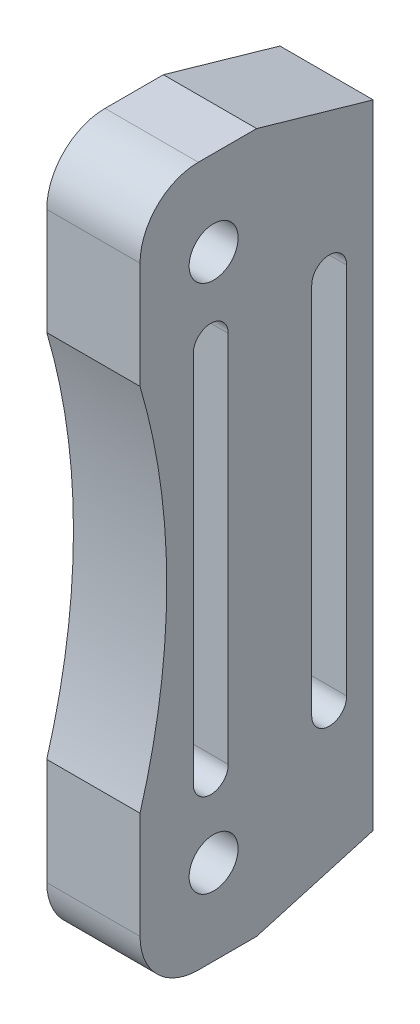
ISO-10303-21;
HEADER;
FILE_DESCRIPTION(('STEP AP214'),'2;1');
FILE_NAME('part.step','',(''),(''),'','','');
FILE_SCHEMA(('AUTOMOTIVE_DESIGN { 1 0 10303 214 1 1 1 1 }'));
ENDSEC;
DATA;
#1=APPLICATION_CONTEXT('core data for automotive mechanical design processes');
#2=APPLICATION_PROTOCOL_DEFINITION('international standard','automotive_design',2000,#1);
#3=PRODUCT_CONTEXT('',#1,'mechanical');
#4=PRODUCT('Part','Part','',(#3));
#5=PRODUCT_RELATED_PRODUCT_CATEGORY('part','',(#4));
#6=PRODUCT_DEFINITION_FORMATION('','',#4);
#7=PRODUCT_DEFINITION_CONTEXT('part definition',#1,'design');
#8=PRODUCT_DEFINITION('design','',#6,#7);
#9=PRODUCT_DEFINITION_SHAPE('','',#8);
#10=(LENGTH_UNIT() NAMED_UNIT(*) SI_UNIT(.MILLI.,.METRE.));
#11=(NAMED_UNIT(*) PLANE_ANGLE_UNIT() SI_UNIT($,.RADIAN.));
#12=(NAMED_UNIT(*) SI_UNIT($,.STERADIAN.) SOLID_ANGLE_UNIT());
#13=UNCERTAINTY_MEASURE_WITH_UNIT(LENGTH_MEASURE(1.E-05),#10,'distance_accuracy_value','');
#14=(GEOMETRIC_REPRESENTATION_CONTEXT(3) GLOBAL_UNCERTAINTY_ASSIGNED_CONTEXT((#13)) GLOBAL_UNIT_ASSIGNED_CONTEXT((#10,
#11,#12)) REPRESENTATION_CONTEXT('',''));
#15=CARTESIAN_POINT('',(0.,0.,0.));
#16=DIRECTION('',(0.,0.,1.));
#17=DIRECTION('',(1.,0.,0.));
#18=AXIS2_PLACEMENT_3D('',#15,#16,#17);
#19=CARTESIAN_POINT('',(-8.,0.,63.71));
#20=DIRECTION('',(1.,0.,0.));
#21=DIRECTION('',(0.,0.,-1.));
#22=AXIS2_PLACEMENT_3D('',#19,#20,#21);
#23=CYLINDRICAL_SURFACE('',#22,56.);
#24=CARTESIAN_POINT('',(0.,0.,63.71));
#25=DIRECTION('',(1.,0.,0.));
#26=DIRECTION('',(0.,0.,-1.));
#27=AXIS2_PLACEMENT_3D('',#24,#25,#26);
#28=CIRCLE('',#27,56.);
#29=CARTESIAN_POINT('',(0.,-15.8504227072971,10.));
#30=VERTEX_POINT('',#29);
#31=CARTESIAN_POINT('',(0.,15.8504227072971,10.));
#32=VERTEX_POINT('',#31);
#33=EDGE_CURVE('E185',#30,#32,#28,.T.);
#34=ORIENTED_EDGE('',*,*,#33,.T.);
#35=DIRECTION('',(1.,0.,0.));
#36=VECTOR('',#35,1.);
#37=CARTESIAN_POINT('',(-8.,15.8504227072971,10.));
#38=LINE('',#37,#36);
#39=CARTESIAN_POINT('',(-8.,15.8504227072971,10.));
#40=VERTEX_POINT('',#39);
#41=EDGE_CURVE('E282',#40,#32,#38,.T.);
#42=ORIENTED_EDGE('',*,*,#41,.F.);
#43=CARTESIAN_POINT('',(-8.,0.,63.71));
#44=DIRECTION('',(1.,0.,0.));
#45=DIRECTION('',(0.,0.,-1.));
#46=AXIS2_PLACEMENT_3D('',#43,#44,#45);
#47=CIRCLE('',#46,56.);
#48=CARTESIAN_POINT('',(-8.,-15.8504227072971,10.));
#49=VERTEX_POINT('',#48);
#50=EDGE_CURVE('E238',#49,#40,#47,.T.);
#51=ORIENTED_EDGE('',*,*,#50,.F.);
#52=DIRECTION('',(1.,0.,0.));
#53=VECTOR('',#52,1.);
#54=CARTESIAN_POINT('',(-8.,-15.8504227072971,10.));
#55=LINE('',#54,#53);
#56=EDGE_CURVE('E261',#49,#30,#55,.T.);
#57=ORIENTED_EDGE('',*,*,#56,.T.);
#58=EDGE_LOOP('',(#34,#42,#51,#57));
#59=FACE_BOUND('',#58,.T.);
#60=ADVANCED_FACE('F42',(#59),#23,.F.);
#61=CARTESIAN_POINT('',(-8.,0.,10.));
#62=DIRECTION('',(0.,0.,1.));
#63=DIRECTION('',(1.,0.,0.));
#64=AXIS2_PLACEMENT_3D('',#61,#62,#63);
#65=PLANE('',#64);
#66=DIRECTION('',(0.,-1.,0.));
#67=VECTOR('',#66,1.);
#68=CARTESIAN_POINT('',(0.,0.,10.));
#69=LINE('',#68,#67);
#70=CARTESIAN_POINT('',(0.,25.,10.));
#71=VERTEX_POINT('',#70);
#72=EDGE_CURVE('E268',#71,#32,#69,.T.);
#73=ORIENTED_EDGE('',*,*,#72,.F.);
#74=DIRECTION('',(1.,0.,0.));
#75=VECTOR('',#74,1.);
#76=CARTESIAN_POINT('',(-8.,25.,10.));
#77=LINE('',#76,#75);
#78=CARTESIAN_POINT('',(-8.,25.,10.));
#79=VERTEX_POINT('',#78);
#80=EDGE_CURVE('E302',#71,#79,#77,.F.);
#81=ORIENTED_EDGE('',*,*,#80,.T.);
#82=DIRECTION('',(0.,-1.,0.));
#83=VECTOR('',#82,1.);
#84=CARTESIAN_POINT('',(-8.,0.,10.));
#85=LINE('',#84,#83);
#86=EDGE_CURVE('E246',#79,#40,#85,.T.);
#87=ORIENTED_EDGE('',*,*,#86,.T.);
#88=ORIENTED_EDGE('',*,*,#41,.T.);
#89=EDGE_LOOP('',(#73,#81,#87,#88));
#90=FACE_BOUND('',#89,.T.);
#91=ADVANCED_FACE('F353',(#90),#65,.T.);
#92=CARTESIAN_POINT('',(-8.,30.,0.));
#93=DIRECTION('',(0.,-1.,0.));
#94=DIRECTION('',(0.,0.,-1.));
#95=AXIS2_PLACEMENT_3D('',#92,#93,#94);
#96=PLANE('',#95);
#97=DIRECTION('',(0.,0.,-1.));
#98=VECTOR('',#97,1.);
#99=CARTESIAN_POINT('',(0.,30.,0.));
#100=LINE('',#99,#98);
#101=CARTESIAN_POINT('',(0.,30.,5.));
#102=VERTEX_POINT('',#101);
#103=CARTESIAN_POINT('',(0.,30.,1.05818132034585E-13));
#104=VERTEX_POINT('',#103);
#105=EDGE_CURVE('E274',#102,#104,#100,.T.);
#106=ORIENTED_EDGE('',*,*,#105,.T.);
#107=DIRECTION('',(-1.,0.,0.));
#108=VECTOR('',#107,1.);
#109=CARTESIAN_POINT('',(-8.,30.,1.05818132034585E-13));
#110=LINE('',#109,#108);
#111=CARTESIAN_POINT('',(-8.,30.,1.05818132034585E-13));
#112=VERTEX_POINT('',#111);
#113=EDGE_CURVE('E11',#104,#112,#110,.T.);
#114=ORIENTED_EDGE('',*,*,#113,.T.);
#115=DIRECTION('',(0.,0.,-1.));
#116=VECTOR('',#115,1.);
#117=CARTESIAN_POINT('',(-8.,30.,0.));
#118=LINE('',#117,#116);
#119=CARTESIAN_POINT('',(-8.,30.,5.));
#120=VERTEX_POINT('',#119);
#121=EDGE_CURVE('E252',#120,#112,#118,.T.);
#122=ORIENTED_EDGE('',*,*,#121,.F.);
#123=DIRECTION('',(1.,0.,0.));
#124=VECTOR('',#123,1.);
#125=CARTESIAN_POINT('',(0.,30.,5.));
#126=LINE('',#125,#124);
#127=EDGE_CURVE('E299',#120,#102,#126,.T.);
#128=ORIENTED_EDGE('',*,*,#127,.T.);
#129=EDGE_LOOP('',(#106,#114,#122,#128));
#130=FACE_BOUND('',#129,.T.);
#131=ADVANCED_FACE('F343',(#130),#96,.F.);
#132=CARTESIAN_POINT('',(-8.,0.,-10.));
#133=DIRECTION('',(0.,0.,1.));
#134=DIRECTION('',(1.,0.,0.));
#135=AXIS2_PLACEMENT_3D('',#132,#133,#134);
#136=PLANE('',#135);
#137=DIRECTION('',(0.,-1.,0.));
#138=VECTOR('',#137,1.);
#139=CARTESIAN_POINT('',(0.,0.,-10.));
#140=LINE('',#139,#138);
#141=CARTESIAN_POINT('',(0.,27.1325461424119,-10.));
#142=VERTEX_POINT('',#141);
#143=CARTESIAN_POINT('',(0.,-27.1325461424119,-10.));
#144=VERTEX_POINT('',#143);
#145=EDGE_CURVE('E271',#142,#144,#140,.T.);
#146=ORIENTED_EDGE('',*,*,#145,.T.);
#147=DIRECTION('',(-1.,0.,0.));
#148=VECTOR('',#147,1.);
#149=CARTESIAN_POINT('',(-8.,-27.1325461424119,-10.));
#150=LINE('',#149,#148);
#151=CARTESIAN_POINT('',(-8.,-27.1325461424119,-10.));
#152=VERTEX_POINT('',#151);
#153=EDGE_CURVE('E314',#144,#152,#150,.T.);
#154=ORIENTED_EDGE('',*,*,#153,.T.);
#155=DIRECTION('',(0.,-1.,0.));
#156=VECTOR('',#155,1.);
#157=CARTESIAN_POINT('',(-8.,0.,-10.));
#158=LINE('',#157,#156);
#159=CARTESIAN_POINT('',(-8.,27.1325461424119,-10.));
#160=VERTEX_POINT('',#159);
#161=EDGE_CURVE('E249',#160,#152,#158,.T.);
#162=ORIENTED_EDGE('',*,*,#161,.F.);
#163=DIRECTION('',(1.,0.,0.));
#164=VECTOR('',#163,1.);
#165=CARTESIAN_POINT('',(-8.,27.1325461424119,-10.));
#166=LINE('',#165,#164);
#167=EDGE_CURVE('E311',#160,#142,#166,.T.);
#168=ORIENTED_EDGE('',*,*,#167,.T.);
#169=EDGE_LOOP('',(#146,#154,#162,#168));
#170=FACE_BOUND('',#169,.T.);
#171=ADVANCED_FACE('F336',(#170),#136,.F.);
#172=CARTESIAN_POINT('',(-8.,-30.,0.));
#173=DIRECTION('',(0.,-1.,0.));
#174=DIRECTION('',(0.,0.,-1.));
#175=AXIS2_PLACEMENT_3D('',#172,#173,#174);
#176=PLANE('',#175);
#177=DIRECTION('',(0.,0.,-1.));
#178=VECTOR('',#177,1.);
#179=CARTESIAN_POINT('',(-8.,-30.,0.));
#180=LINE('',#179,#178);
#181=CARTESIAN_POINT('',(-8.,-30.,5.));
#182=VERTEX_POINT('',#181);
#183=CARTESIAN_POINT('',(-8.,-30.,1.05818132034585E-13));
#184=VERTEX_POINT('',#183);
#185=EDGE_CURVE('E245',#182,#184,#180,.T.);
#186=ORIENTED_EDGE('',*,*,#185,.T.);
#187=DIRECTION('',(1.,0.,0.));
#188=VECTOR('',#187,1.);
#189=CARTESIAN_POINT('',(0.,-30.,1.05818132034585E-13));
#190=LINE('',#189,#188);
#191=CARTESIAN_POINT('',(0.,-30.,1.05818132034585E-13));
#192=VERTEX_POINT('',#191);
#193=EDGE_CURVE('E304',#184,#192,#190,.T.);
#194=ORIENTED_EDGE('',*,*,#193,.T.);
#195=DIRECTION('',(0.,0.,-1.));
#196=VECTOR('',#195,1.);
#197=CARTESIAN_POINT('',(0.,-30.,0.));
#198=LINE('',#197,#196);
#199=CARTESIAN_POINT('',(0.,-30.,5.));
#200=VERTEX_POINT('',#199);
#201=EDGE_CURVE('E267',#200,#192,#198,.T.);
#202=ORIENTED_EDGE('',*,*,#201,.F.);
#203=DIRECTION('',(1.,0.,0.));
#204=VECTOR('',#203,1.);
#205=CARTESIAN_POINT('',(-8.,-30.,5.));
#206=LINE('',#205,#204);
#207=EDGE_CURVE('E293',#200,#182,#206,.F.);
#208=ORIENTED_EDGE('',*,*,#207,.T.);
#209=EDGE_LOOP('',(#186,#194,#202,#208));
#210=FACE_BOUND('',#209,.T.);
#211=ADVANCED_FACE('F327',(#210),#176,.T.);
#212=CARTESIAN_POINT('',(-8.,22.685,3.69000000000001));
#213=DIRECTION('',(1.,0.,0.));
#214=DIRECTION('',(0.,0.,-1.));
#215=AXIS2_PLACEMENT_3D('',#212,#213,#214);
#216=CYLINDRICAL_SURFACE('',#215,2.1);
#217=CARTESIAN_POINT('',(-8.,22.685,3.69000000000001));
#218=DIRECTION('',(1.,0.,0.));
#219=DIRECTION('',(0.,0.,-1.));
#220=AXIS2_PLACEMENT_3D('',#217,#218,#219);
#221=CIRCLE('',#220,2.1);
#222=CARTESIAN_POINT('',(-8.,22.685,1.59));
#223=VERTEX_POINT('',#222);
#224=EDGE_CURVE('E255',#223,#223,#221,.T.);
#225=ORIENTED_EDGE('',*,*,#224,.F.);
#226=EDGE_LOOP('',(#225));
#227=FACE_BOUND('',#226,.T.);
#228=CARTESIAN_POINT('',(0.,22.685,3.69000000000001));
#229=DIRECTION('',(1.,0.,0.));
#230=DIRECTION('',(0.,0.,-1.));
#231=AXIS2_PLACEMENT_3D('',#228,#229,#230);
#232=CIRCLE('',#231,2.1);
#233=CARTESIAN_POINT('',(0.,22.685,1.59));
#234=VERTEX_POINT('',#233);
#235=EDGE_CURVE('E277',#234,#234,#232,.T.);
#236=ORIENTED_EDGE('',*,*,#235,.T.);
#237=EDGE_LOOP('',(#236));
#238=FACE_BOUND('',#237,.T.);
#239=ADVANCED_FACE('F383',(#227,#238),#216,.F.);
#240=CARTESIAN_POINT('',(-8.,-25.,10.));
#241=VERTEX_POINT('',#240);
#242=EDGE_CURVE('E241',#49,#241,#85,.T.);
#243=ORIENTED_EDGE('',*,*,#242,.T.);
#244=DIRECTION('',(1.,0.,0.));
#245=VECTOR('',#244,1.);
#246=CARTESIAN_POINT('',(-8.,-25.,10.));
#247=LINE('',#246,#245);
#248=CARTESIAN_POINT('',(0.,-25.,10.));
#249=VERTEX_POINT('',#248);
#250=EDGE_CURVE('E285',#241,#249,#247,.T.);
#251=ORIENTED_EDGE('',*,*,#250,.T.);
#252=EDGE_CURVE('E264',#30,#249,#69,.T.);
#253=ORIENTED_EDGE('',*,*,#252,.F.);
#254=ORIENTED_EDGE('',*,*,#56,.F.);
#255=EDGE_LOOP('',(#243,#251,#253,#254));
#256=FACE_BOUND('',#255,.T.);
#257=ADVANCED_FACE('F360',(#256),#65,.T.);
#258=CARTESIAN_POINT('',(-8.,-22.685,3.69000000000001));
#259=DIRECTION('',(1.,0.,0.));
#260=DIRECTION('',(0.,0.,-1.));
#261=AXIS2_PLACEMENT_3D('',#258,#259,#260);
#262=CYLINDRICAL_SURFACE('',#261,2.1);
#263=CARTESIAN_POINT('',(-8.,-22.685,3.69000000000001));
#264=DIRECTION('',(1.,0.,0.));
#265=DIRECTION('',(0.,0.,-1.));
#266=AXIS2_PLACEMENT_3D('',#263,#264,#265);
#267=CIRCLE('',#266,2.1);
#268=CARTESIAN_POINT('',(-8.,-22.685,1.59));
#269=VERTEX_POINT('',#268);
#270=EDGE_CURVE('E258',#269,#269,#267,.F.);
#271=ORIENTED_EDGE('',*,*,#270,.T.);
#272=EDGE_LOOP('',(#271));
#273=FACE_BOUND('',#272,.T.);
#274=CARTESIAN_POINT('',(0.,-22.685,3.69000000000001));
#275=DIRECTION('',(1.,0.,0.));
#276=DIRECTION('',(0.,0.,-1.));
#277=AXIS2_PLACEMENT_3D('',#274,#275,#276);
#278=CIRCLE('',#277,2.1);
#279=CARTESIAN_POINT('',(0.,-22.685,1.59));
#280=VERTEX_POINT('',#279);
#281=EDGE_CURVE('E242',#280,#280,#278,.F.);
#282=ORIENTED_EDGE('',*,*,#281,.F.);
#283=EDGE_LOOP('',(#282));
#284=FACE_BOUND('',#283,.T.);
#285=ADVANCED_FACE('F391',(#273,#284),#262,.F.);
#286=CARTESIAN_POINT('',(-8.,0.,0.));
#287=DIRECTION('',(1.,0.,0.));
#288=DIRECTION('',(0.,0.,-1.));
#289=AXIS2_PLACEMENT_3D('',#286,#287,#288);
#290=PLANE('',#289);
#291=DIRECTION('',(0.,-1.,0.));
#292=VECTOR('',#291,1.);
#293=CARTESIAN_POINT('',(-8.,16.,-7.725));
#294=LINE('',#293,#292);
#295=CARTESIAN_POINT('',(-8.,16.,-7.725));
#296=VERTEX_POINT('',#295);
#297=CARTESIAN_POINT('',(-8.,-16.,-7.725));
#298=VERTEX_POINT('',#297);
#299=EDGE_CURVE('E191',#296,#298,#294,.T.);
#300=ORIENTED_EDGE('',*,*,#299,.F.);
#301=CARTESIAN_POINT('',(-8.,16.,-6.22499999999999));
#302=DIRECTION('',(1.,0.,0.));
#303=DIRECTION('',(0.,0.,-1.));
#304=AXIS2_PLACEMENT_3D('',#301,#302,#303);
#305=CIRCLE('',#304,1.50000000000001);
#306=CARTESIAN_POINT('',(-8.,16.,-4.72499999999998));
#307=VERTEX_POINT('',#306);
#308=EDGE_CURVE('E171',#307,#296,#305,.F.);
#309=ORIENTED_EDGE('',*,*,#308,.F.);
#310=DIRECTION('',(0.,1.,0.));
#311=VECTOR('',#310,1.);
#312=CARTESIAN_POINT('',(-8.,16.,-4.72499999999998));
#313=LINE('',#312,#311);
#314=CARTESIAN_POINT('',(-8.,-16.,-4.72499999999998));
#315=VERTEX_POINT('',#314);
#316=EDGE_CURVE('E182',#315,#307,#313,.T.);
#317=ORIENTED_EDGE('',*,*,#316,.F.);
#318=CARTESIAN_POINT('',(-8.,-16.,-6.22499999999999));
#319=DIRECTION('',(1.,0.,0.));
#320=DIRECTION('',(0.,0.,-1.));
#321=AXIS2_PLACEMENT_3D('',#318,#319,#320);
#322=CIRCLE('',#321,1.50000000000001);
#323=EDGE_CURVE('E58',#298,#315,#322,.F.);
#324=ORIENTED_EDGE('',*,*,#323,.F.);
#325=EDGE_LOOP('',(#300,#309,#317,#324));
#326=FACE_BOUND('',#325,.T.);
#327=DIRECTION('',(0.,-1.,0.));
#328=VECTOR('',#327,1.);
#329=CARTESIAN_POINT('',(-8.,16.,2.43499999999999));
#330=LINE('',#329,#328);
#331=CARTESIAN_POINT('',(-8.,16.,2.43499999999999));
#332=VERTEX_POINT('',#331);
#333=CARTESIAN_POINT('',(-8.,-16.,2.43499999999999));
#334=VERTEX_POINT('',#333);
#335=EDGE_CURVE('E234',#332,#334,#330,.T.);
#336=ORIENTED_EDGE('',*,*,#335,.F.);
#337=CARTESIAN_POINT('',(-8.,16.,3.935));
#338=DIRECTION('',(1.,0.,0.));
#339=DIRECTION('',(0.,0.,-1.));
#340=AXIS2_PLACEMENT_3D('',#337,#338,#339);
#341=CIRCLE('',#340,1.50000000000001);
#342=CARTESIAN_POINT('',(-8.,16.,5.435));
#343=VERTEX_POINT('',#342);
#344=EDGE_CURVE('E231',#343,#332,#341,.F.);
#345=ORIENTED_EDGE('',*,*,#344,.F.);
#346=DIRECTION('',(0.,1.,0.));
#347=VECTOR('',#346,1.);
#348=CARTESIAN_POINT('',(-8.,16.,5.435));
#349=LINE('',#348,#347);
#350=CARTESIAN_POINT('',(-8.,-16.,5.435));
#351=VERTEX_POINT('',#350);
#352=EDGE_CURVE('E208',#351,#343,#349,.T.);
#353=ORIENTED_EDGE('',*,*,#352,.F.);
#354=CARTESIAN_POINT('',(-8.,-16.,3.935));
#355=DIRECTION('',(1.,0.,0.));
#356=DIRECTION('',(0.,0.,-1.));
#357=AXIS2_PLACEMENT_3D('',#354,#355,#356);
#358=CIRCLE('',#357,1.50000000000001);
#359=EDGE_CURVE('E66',#334,#351,#358,.F.);
#360=ORIENTED_EDGE('',*,*,#359,.F.);
#361=EDGE_LOOP('',(#336,#345,#353,#360));
#362=FACE_BOUND('',#361,.T.);
#363=ORIENTED_EDGE('',*,*,#161,.T.);
#364=DIRECTION('',(0.,-0.275637355816996,0.96126169593832));
#365=VECTOR('',#364,1.);
#366=CARTESIAN_POINT('',(-8.,-30.,1.05818132034585E-13));
#367=LINE('',#366,#365);
#368=EDGE_CURVE('E51',#152,#184,#367,.T.);
#369=ORIENTED_EDGE('',*,*,#368,.T.);
#370=ORIENTED_EDGE('',*,*,#185,.F.);
#371=CARTESIAN_POINT('',(-8.,-25.,5.));
#372=DIRECTION('',(1.,0.,0.));
#373=DIRECTION('',(0.,0.,-1.));
#374=AXIS2_PLACEMENT_3D('',#371,#372,#373);
#375=CIRCLE('',#374,5.);
#376=EDGE_CURVE('E297',#182,#241,#375,.F.);
#377=ORIENTED_EDGE('',*,*,#376,.T.);
#378=ORIENTED_EDGE('',*,*,#242,.F.);
#379=ORIENTED_EDGE('',*,*,#50,.T.);
#380=ORIENTED_EDGE('',*,*,#86,.F.);
#381=CARTESIAN_POINT('',(-8.,25.,5.));
#382=DIRECTION('',(1.,0.,0.));
#383=DIRECTION('',(0.,0.,-1.));
#384=AXIS2_PLACEMENT_3D('',#381,#382,#383);
#385=CIRCLE('',#384,5.);
#386=EDGE_CURVE('E295',#79,#120,#385,.F.);
#387=ORIENTED_EDGE('',*,*,#386,.T.);
#388=ORIENTED_EDGE('',*,*,#121,.T.);
#389=DIRECTION('',(0.,0.275637355816996,0.96126169593832));
#390=VECTOR('',#389,1.);
#391=CARTESIAN_POINT('',(-8.,27.1325461424119,-10.));
#392=LINE('',#391,#390);
#393=EDGE_CURVE('E316',#112,#160,#392,.F.);
#394=ORIENTED_EDGE('',*,*,#393,.T.);
#395=EDGE_LOOP('',(#363,#369,#370,#377,#378,#379,#380,#387,#388,#394));
#396=FACE_BOUND('',#395,.T.);
#397=ORIENTED_EDGE('',*,*,#224,.T.);
#398=EDGE_LOOP('',(#397));
#399=FACE_BOUND('',#398,.T.);
#400=ORIENTED_EDGE('',*,*,#270,.F.);
#401=EDGE_LOOP('',(#400));
#402=FACE_BOUND('',#401,.T.);
#403=ADVANCED_FACE('F188',(#326,#362,#396,#399,#402),#290,.F.);
#404=CARTESIAN_POINT('',(0.,0.,0.));
#405=DIRECTION('',(1.,0.,0.));
#406=DIRECTION('',(0.,0.,-1.));
#407=AXIS2_PLACEMENT_3D('',#404,#405,#406);
#408=PLANE('',#407);
#409=CARTESIAN_POINT('',(0.,16.,-6.22499999999999));
#410=DIRECTION('',(1.,0.,0.));
#411=DIRECTION('',(0.,0.,-1.));
#412=AXIS2_PLACEMENT_3D('',#409,#410,#411);
#413=CIRCLE('',#412,1.50000000000001);
#414=CARTESIAN_POINT('',(0.,16.,-7.725));
#415=VERTEX_POINT('',#414);
#416=CARTESIAN_POINT('',(0.,16.,-4.72499999999998));
#417=VERTEX_POINT('',#416);
#418=EDGE_CURVE('E174',#415,#417,#413,.T.);
#419=ORIENTED_EDGE('',*,*,#418,.F.);
#420=DIRECTION('',(0.,1.,0.));
#421=VECTOR('',#420,1.);
#422=CARTESIAN_POINT('',(0.,16.,-7.725));
#423=LINE('',#422,#421);
#424=CARTESIAN_POINT('',(0.,-16.,-7.725));
#425=VERTEX_POINT('',#424);
#426=EDGE_CURVE('E179',#425,#415,#423,.T.);
#427=ORIENTED_EDGE('',*,*,#426,.F.);
#428=CARTESIAN_POINT('',(0.,-16.,-6.22499999999999));
#429=DIRECTION('',(1.,0.,0.));
#430=DIRECTION('',(0.,0.,-1.));
#431=AXIS2_PLACEMENT_3D('',#428,#429,#430);
#432=CIRCLE('',#431,1.50000000000001);
#433=CARTESIAN_POINT('',(0.,-16.,-4.72499999999999));
#434=VERTEX_POINT('',#433);
#435=EDGE_CURVE('E199',#434,#425,#432,.T.);
#436=ORIENTED_EDGE('',*,*,#435,.F.);
#437=DIRECTION('',(0.,-1.,0.));
#438=VECTOR('',#437,1.);
#439=CARTESIAN_POINT('',(0.,16.,-4.72499999999998));
#440=LINE('',#439,#438);
#441=EDGE_CURVE('E193',#417,#434,#440,.T.);
#442=ORIENTED_EDGE('',*,*,#441,.F.);
#443=EDGE_LOOP('',(#419,#427,#436,#442));
#444=FACE_BOUND('',#443,.T.);
#445=CARTESIAN_POINT('',(0.,16.,3.935));
#446=DIRECTION('',(1.,0.,0.));
#447=DIRECTION('',(0.,0.,1.));
#448=AXIS2_PLACEMENT_3D('',#445,#446,#447);
#449=CIRCLE('',#448,1.50000000000001);
#450=CARTESIAN_POINT('',(0.,16.,2.43499999999999));
#451=VERTEX_POINT('',#450);
#452=CARTESIAN_POINT('',(0.,16.,5.435));
#453=VERTEX_POINT('',#452);
#454=EDGE_CURVE('E229',#451,#453,#449,.T.);
#455=ORIENTED_EDGE('',*,*,#454,.F.);
#456=DIRECTION('',(0.,1.,0.));
#457=VECTOR('',#456,1.);
#458=CARTESIAN_POINT('',(0.,16.,2.43499999999999));
#459=LINE('',#458,#457);
#460=CARTESIAN_POINT('',(0.,-16.,2.43499999999999));
#461=VERTEX_POINT('',#460);
#462=EDGE_CURVE('E215',#461,#451,#459,.T.);
#463=ORIENTED_EDGE('',*,*,#462,.F.);
#464=CARTESIAN_POINT('',(0.,-16.,3.935));
#465=DIRECTION('',(1.,0.,0.));
#466=DIRECTION('',(0.,0.,1.));
#467=AXIS2_PLACEMENT_3D('',#464,#465,#466);
#468=CIRCLE('',#467,1.50000000000001);
#469=CARTESIAN_POINT('',(0.,-16.,5.435));
#470=VERTEX_POINT('',#469);
#471=EDGE_CURVE('E223',#470,#461,#468,.T.);
#472=ORIENTED_EDGE('',*,*,#471,.F.);
#473=DIRECTION('',(0.,-1.,0.));
#474=VECTOR('',#473,1.);
#475=CARTESIAN_POINT('',(0.,16.,5.435));
#476=LINE('',#475,#474);
#477=EDGE_CURVE('E226',#453,#470,#476,.T.);
#478=ORIENTED_EDGE('',*,*,#477,.F.);
#479=EDGE_LOOP('',(#455,#463,#472,#478));
#480=FACE_BOUND('',#479,.T.);
#481=ORIENTED_EDGE('',*,*,#201,.T.);
#482=DIRECTION('',(0.,0.275637355816996,-0.96126169593832));
#483=VECTOR('',#482,1.);
#484=CARTESIAN_POINT('',(0.,-27.7207214423464,-7.94878896349799));
#485=LINE('',#484,#483);
#486=EDGE_CURVE('E309',#192,#144,#485,.T.);
#487=ORIENTED_EDGE('',*,*,#486,.T.);
#488=ORIENTED_EDGE('',*,*,#145,.F.);
#489=DIRECTION('',(0.,-0.275637355816996,-0.96126169593832));
#490=VECTOR('',#489,1.);
#491=CARTESIAN_POINT('',(0.,27.7207214423464,-7.94878896349799));
#492=LINE('',#491,#490);
#493=EDGE_CURVE('E307',#142,#104,#492,.F.);
#494=ORIENTED_EDGE('',*,*,#493,.T.);
#495=ORIENTED_EDGE('',*,*,#105,.F.);
#496=CARTESIAN_POINT('',(0.,25.,5.));
#497=DIRECTION('',(1.,0.,0.));
#498=DIRECTION('',(0.,0.,-1.));
#499=AXIS2_PLACEMENT_3D('',#496,#497,#498);
#500=CIRCLE('',#499,5.);
#501=EDGE_CURVE('E289',#102,#71,#500,.T.);
#502=ORIENTED_EDGE('',*,*,#501,.T.);
#503=ORIENTED_EDGE('',*,*,#72,.T.);
#504=ORIENTED_EDGE('',*,*,#33,.F.);
#505=ORIENTED_EDGE('',*,*,#252,.T.);
#506=CARTESIAN_POINT('',(0.,-25.,5.));
#507=DIRECTION('',(1.,0.,0.));
#508=DIRECTION('',(0.,0.,-1.));
#509=AXIS2_PLACEMENT_3D('',#506,#507,#508);
#510=CIRCLE('',#509,5.);
#511=EDGE_CURVE('E291',#249,#200,#510,.T.);
#512=ORIENTED_EDGE('',*,*,#511,.T.);
#513=EDGE_LOOP('',(#481,#487,#488,#494,#495,#502,#503,#504,#505,#512));
#514=FACE_BOUND('',#513,.T.);
#515=ORIENTED_EDGE('',*,*,#235,.F.);
#516=EDGE_LOOP('',(#515));
#517=FACE_BOUND('',#516,.T.);
#518=ORIENTED_EDGE('',*,*,#281,.T.);
#519=EDGE_LOOP('',(#518));
#520=FACE_BOUND('',#519,.T.);
#521=ADVANCED_FACE('F333',(#444,#480,#514,#517,#520),#408,.T.);
#522=CARTESIAN_POINT('',(-8.,-25.,5.));
#523=DIRECTION('',(1.,0.,0.));
#524=DIRECTION('',(0.,0.,-1.));
#525=AXIS2_PLACEMENT_3D('',#522,#523,#524);
#526=CYLINDRICAL_SURFACE('',#525,5.);
#527=ORIENTED_EDGE('',*,*,#376,.F.);
#528=ORIENTED_EDGE('',*,*,#207,.F.);
#529=ORIENTED_EDGE('',*,*,#511,.F.);
#530=ORIENTED_EDGE('',*,*,#250,.F.);
#531=EDGE_LOOP('',(#527,#528,#529,#530));
#532=FACE_BOUND('',#531,.T.);
#533=ADVANCED_FACE('F364',(#532),#526,.T.);
#534=CARTESIAN_POINT('',(-8.,25.,5.));
#535=DIRECTION('',(-1.,0.,0.));
#536=DIRECTION('',(0.,0.,1.));
#537=AXIS2_PLACEMENT_3D('',#534,#535,#536);
#538=CYLINDRICAL_SURFACE('',#537,5.);
#539=ORIENTED_EDGE('',*,*,#386,.F.);
#540=ORIENTED_EDGE('',*,*,#80,.F.);
#541=ORIENTED_EDGE('',*,*,#501,.F.);
#542=ORIENTED_EDGE('',*,*,#127,.F.);
#543=EDGE_LOOP('',(#539,#540,#541,#542));
#544=FACE_BOUND('',#543,.T.);
#545=ADVANCED_FACE('F348',(#544),#538,.T.);
#546=CARTESIAN_POINT('',(-8.,-30.,1.05818132034585E-13));
#547=DIRECTION('',(0.,-0.96126169593832,-0.275637355816996));
#548=DIRECTION('',(-1.,0.,0.));
#549=AXIS2_PLACEMENT_3D('',#546,#547,#548);
#550=PLANE('',#549);
#551=ORIENTED_EDGE('',*,*,#368,.F.);
#552=ORIENTED_EDGE('',*,*,#153,.F.);
#553=ORIENTED_EDGE('',*,*,#486,.F.);
#554=ORIENTED_EDGE('',*,*,#193,.F.);
#555=EDGE_LOOP('',(#551,#552,#553,#554));
#556=FACE_BOUND('',#555,.T.);
#557=ADVANCED_FACE('F330',(#556),#550,.T.);
#558=CARTESIAN_POINT('',(-8.,27.1325461424119,-10.));
#559=DIRECTION('',(0.,-0.96126169593832,0.275637355816996));
#560=DIRECTION('',(1.,0.,0.));
#561=AXIS2_PLACEMENT_3D('',#558,#559,#560);
#562=PLANE('',#561);
#563=ORIENTED_EDGE('',*,*,#393,.F.);
#564=ORIENTED_EDGE('',*,*,#113,.F.);
#565=ORIENTED_EDGE('',*,*,#493,.F.);
#566=ORIENTED_EDGE('',*,*,#167,.F.);
#567=EDGE_LOOP('',(#563,#564,#565,#566));
#568=FACE_BOUND('',#567,.T.);
#569=ADVANCED_FACE('F45',(#568),#562,.F.);
#570=CARTESIAN_POINT('',(-8.001,16.,3.935));
#571=DIRECTION('',(1.,0.,0.));
#572=DIRECTION('',(0.,0.,-1.));
#573=AXIS2_PLACEMENT_3D('',#570,#571,#572);
#574=CYLINDRICAL_SURFACE('',#573,1.50000000000001);
#575=ORIENTED_EDGE('',*,*,#344,.T.);
#576=DIRECTION('',(1.,0.,0.));
#577=VECTOR('',#576,1.);
#578=CARTESIAN_POINT('',(-8.001,16.,2.43499999999999));
#579=LINE('',#578,#577);
#580=EDGE_CURVE('E211',#332,#451,#579,.T.);
#581=ORIENTED_EDGE('',*,*,#580,.T.);
#582=ORIENTED_EDGE('',*,*,#454,.T.);
#583=DIRECTION('',(1.,0.,0.));
#584=VECTOR('',#583,1.);
#585=CARTESIAN_POINT('',(-8.001,16.,5.435));
#586=LINE('',#585,#584);
#587=EDGE_CURVE('E212',#343,#453,#586,.T.);
#588=ORIENTED_EDGE('',*,*,#587,.F.);
#589=EDGE_LOOP('',(#575,#581,#582,#588));
#590=FACE_BOUND('',#589,.T.);
#591=ADVANCED_FACE('F401',(#590),#574,.F.);
#592=CARTESIAN_POINT('',(-8.001,16.,2.43499999999999));
#593=DIRECTION('',(0.,0.,-1.));
#594=DIRECTION('',(-1.,0.,0.));
#595=AXIS2_PLACEMENT_3D('',#592,#593,#594);
#596=PLANE('',#595);
#597=ORIENTED_EDGE('',*,*,#335,.T.);
#598=DIRECTION('',(1.,0.,0.));
#599=VECTOR('',#598,1.);
#600=CARTESIAN_POINT('',(-8.001,-16.,2.43499999999999));
#601=LINE('',#600,#599);
#602=EDGE_CURVE('E218',#334,#461,#601,.T.);
#603=ORIENTED_EDGE('',*,*,#602,.T.);
#604=ORIENTED_EDGE('',*,*,#462,.T.);
#605=ORIENTED_EDGE('',*,*,#580,.F.);
#606=EDGE_LOOP('',(#597,#603,#604,#605));
#607=FACE_BOUND('',#606,.T.);
#608=ADVANCED_FACE('F397',(#607),#596,.F.);
#609=CARTESIAN_POINT('',(-8.001,-16.,3.935));
#610=DIRECTION('',(1.,0.,0.));
#611=DIRECTION('',(0.,0.,-1.));
#612=AXIS2_PLACEMENT_3D('',#609,#610,#611);
#613=CYLINDRICAL_SURFACE('',#612,1.50000000000001);
#614=ORIENTED_EDGE('',*,*,#359,.T.);
#615=DIRECTION('',(1.,0.,0.));
#616=VECTOR('',#615,1.);
#617=CARTESIAN_POINT('',(-8.001,-16.,5.435));
#618=LINE('',#617,#616);
#619=EDGE_CURVE('E216',#351,#470,#618,.T.);
#620=ORIENTED_EDGE('',*,*,#619,.T.);
#621=ORIENTED_EDGE('',*,*,#471,.T.);
#622=ORIENTED_EDGE('',*,*,#602,.F.);
#623=EDGE_LOOP('',(#614,#620,#621,#622));
#624=FACE_BOUND('',#623,.T.);
#625=ADVANCED_FACE('F400',(#624),#613,.F.);
#626=CARTESIAN_POINT('',(-8.001,16.,5.435));
#627=DIRECTION('',(0.,0.,1.));
#628=DIRECTION('',(1.,0.,0.));
#629=AXIS2_PLACEMENT_3D('',#626,#627,#628);
#630=PLANE('',#629);
#631=ORIENTED_EDGE('',*,*,#352,.T.);
#632=ORIENTED_EDGE('',*,*,#587,.T.);
#633=ORIENTED_EDGE('',*,*,#477,.T.);
#634=ORIENTED_EDGE('',*,*,#619,.F.);
#635=EDGE_LOOP('',(#631,#632,#633,#634));
#636=FACE_BOUND('',#635,.T.);
#637=ADVANCED_FACE('F405',(#636),#630,.F.);
#638=CARTESIAN_POINT('',(-8.001,16.,-6.22499999999999));
#639=DIRECTION('',(1.,0.,0.));
#640=DIRECTION('',(0.,0.,-1.));
#641=AXIS2_PLACEMENT_3D('',#638,#639,#640);
#642=CYLINDRICAL_SURFACE('',#641,1.50000000000001);
#643=ORIENTED_EDGE('',*,*,#308,.T.);
#644=DIRECTION('',(1.,0.,0.));
#645=VECTOR('',#644,1.);
#646=CARTESIAN_POINT('',(-8.001,16.,-7.725));
#647=LINE('',#646,#645);
#648=EDGE_CURVE('E186',#296,#415,#647,.T.);
#649=ORIENTED_EDGE('',*,*,#648,.T.);
#650=ORIENTED_EDGE('',*,*,#418,.T.);
#651=DIRECTION('',(1.,0.,0.));
#652=VECTOR('',#651,1.);
#653=CARTESIAN_POINT('',(-8.001,16.,-4.72499999999998));
#654=LINE('',#653,#652);
#655=EDGE_CURVE('E167',#307,#417,#654,.T.);
#656=ORIENTED_EDGE('',*,*,#655,.F.);
#657=EDGE_LOOP('',(#643,#649,#650,#656));
#658=FACE_BOUND('',#657,.T.);
#659=ADVANCED_FACE('F169',(#658),#642,.F.);
#660=CARTESIAN_POINT('',(-8.001,16.,-7.725));
#661=DIRECTION('',(0.,0.,-1.));
#662=DIRECTION('',(-1.,0.,0.));
#663=AXIS2_PLACEMENT_3D('',#660,#661,#662);
#664=PLANE('',#663);
#665=ORIENTED_EDGE('',*,*,#299,.T.);
#666=DIRECTION('',(1.,0.,0.));
#667=VECTOR('',#666,1.);
#668=CARTESIAN_POINT('',(-8.001,-16.,-7.725));
#669=LINE('',#668,#667);
#670=EDGE_CURVE('E205',#298,#425,#669,.T.);
#671=ORIENTED_EDGE('',*,*,#670,.T.);
#672=ORIENTED_EDGE('',*,*,#426,.T.);
#673=ORIENTED_EDGE('',*,*,#648,.F.);
#674=EDGE_LOOP('',(#665,#671,#672,#673));
#675=FACE_BOUND('',#674,.T.);
#676=ADVANCED_FACE('F414',(#675),#664,.F.);
#677=CARTESIAN_POINT('',(-8.001,-16.,-6.22499999999999));
#678=DIRECTION('',(1.,0.,0.));
#679=DIRECTION('',(0.,0.,-1.));
#680=AXIS2_PLACEMENT_3D('',#677,#678,#679);
#681=CYLINDRICAL_SURFACE('',#680,1.50000000000001);
#682=ORIENTED_EDGE('',*,*,#323,.T.);
#683=DIRECTION('',(1.,0.,0.));
#684=VECTOR('',#683,1.);
#685=CARTESIAN_POINT('',(-8.001,-16.,-4.72499999999999));
#686=LINE('',#685,#684);
#687=EDGE_CURVE('E178',#315,#434,#686,.T.);
#688=ORIENTED_EDGE('',*,*,#687,.T.);
#689=ORIENTED_EDGE('',*,*,#435,.T.);
#690=ORIENTED_EDGE('',*,*,#670,.F.);
#691=EDGE_LOOP('',(#682,#688,#689,#690));
#692=FACE_BOUND('',#691,.T.);
#693=ADVANCED_FACE('F417',(#692),#681,.F.);
#694=CARTESIAN_POINT('',(-8.001,16.,-4.72499999999998));
#695=DIRECTION('',(0.,0.,1.));
#696=DIRECTION('',(1.,0.,0.));
#697=AXIS2_PLACEMENT_3D('',#694,#695,#696);
#698=PLANE('',#697);
#699=ORIENTED_EDGE('',*,*,#316,.T.);
#700=ORIENTED_EDGE('',*,*,#655,.T.);
#701=ORIENTED_EDGE('',*,*,#441,.T.);
#702=ORIENTED_EDGE('',*,*,#687,.F.);
#703=EDGE_LOOP('',(#699,#700,#701,#702));
#704=FACE_BOUND('',#703,.T.);
#705=ADVANCED_FACE('F183',(#704),#698,.F.);
#706=CLOSED_SHELL('',(#60,#91,#131,#171,#211,#239,#257,#285,#403,#521,#533,#545,#557,#569,#591,
#608,#625,#637,#659,#676,#693,#705));
#707=MANIFOLD_SOLID_BREP('B2',#706);
#708=ADVANCED_BREP_SHAPE_REPRESENTATION('',(#18,#707),#14);
#709=SHAPE_DEFINITION_REPRESENTATION(#9,#708);
ENDSEC;
END-ISO-10303-21;
